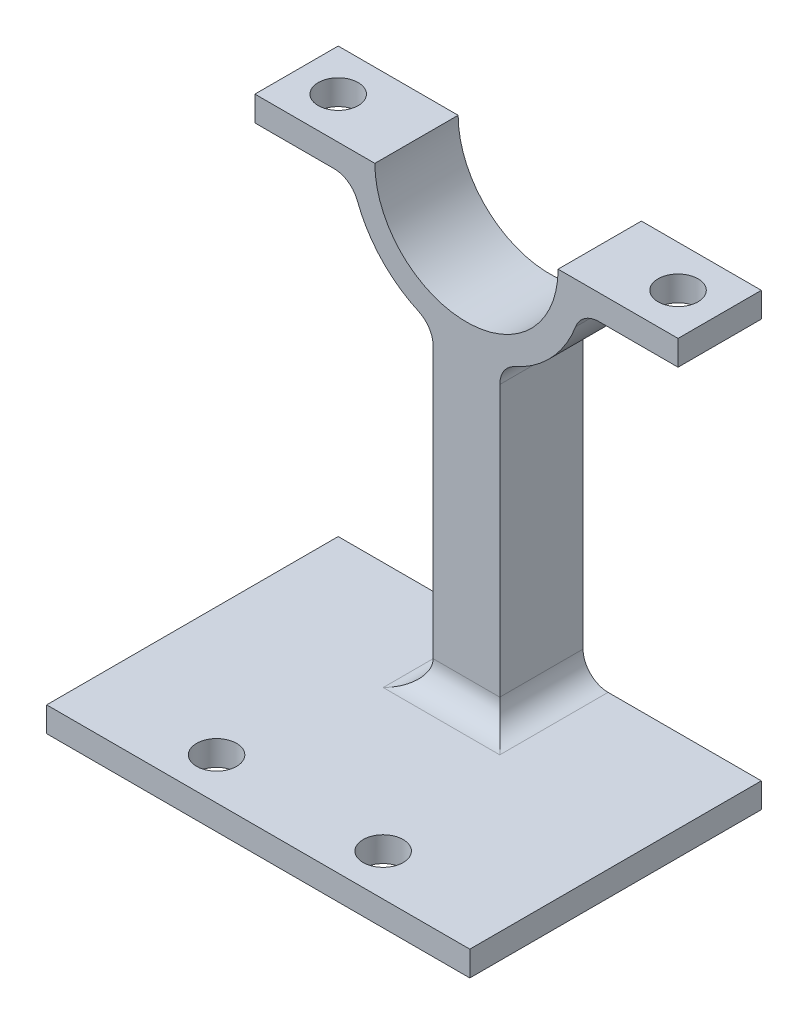
ISO-10303-21;
HEADER;
FILE_DESCRIPTION(('STEP AP214'),'2;1');
FILE_NAME('part.step','',(''),(''),'','','');
FILE_SCHEMA(('AUTOMOTIVE_DESIGN { 1 0 10303 214 1 1 1 1 }'));
ENDSEC;
DATA;
#1=APPLICATION_CONTEXT('core data for automotive mechanical design processes');
#2=APPLICATION_PROTOCOL_DEFINITION('international standard','automotive_design',2000,#1);
#3=PRODUCT_CONTEXT('',#1,'mechanical');
#4=PRODUCT('Part','Part','',(#3));
#5=PRODUCT_RELATED_PRODUCT_CATEGORY('part','',(#4));
#6=PRODUCT_DEFINITION_FORMATION('','',#4);
#7=PRODUCT_DEFINITION_CONTEXT('part definition',#1,'design');
#8=PRODUCT_DEFINITION('design','',#6,#7);
#9=PRODUCT_DEFINITION_SHAPE('','',#8);
#10=(LENGTH_UNIT() NAMED_UNIT(*) SI_UNIT(.MILLI.,.METRE.));
#11=(NAMED_UNIT(*) PLANE_ANGLE_UNIT() SI_UNIT($,.RADIAN.));
#12=(NAMED_UNIT(*) SI_UNIT($,.STERADIAN.) SOLID_ANGLE_UNIT());
#13=UNCERTAINTY_MEASURE_WITH_UNIT(LENGTH_MEASURE(1.E-05),#10,'distance_accuracy_value','');
#14=(GEOMETRIC_REPRESENTATION_CONTEXT(3) GLOBAL_UNCERTAINTY_ASSIGNED_CONTEXT((#13)) GLOBAL_UNIT_ASSIGNED_CONTEXT((#10,
#11,#12)) REPRESENTATION_CONTEXT('',''));
#15=CARTESIAN_POINT('',(0.,0.,0.));
#16=DIRECTION('',(0.,0.,1.));
#17=DIRECTION('',(1.,0.,0.));
#18=AXIS2_PLACEMENT_3D('',#15,#16,#17);
#19=CARTESIAN_POINT('',(0.,0.,2.5));
#20=DIRECTION('',(0.,0.,-1.));
#21=DIRECTION('',(-1.,0.,0.));
#22=AXIS2_PLACEMENT_3D('',#19,#20,#21);
#23=CYLINDRICAL_SURFACE('',#22,7.);
#24=CARTESIAN_POINT('',(0.,0.,2.5));
#25=DIRECTION('',(0.,0.,1.));
#26=DIRECTION('',(1.,0.,0.));
#27=AXIS2_PLACEMENT_3D('',#24,#25,#26);
#28=CIRCLE('',#27,7.);
#29=CARTESIAN_POINT('',(-6.54951859082988,-2.47058823529412,2.5));
#30=VERTEX_POINT('',#29);
#31=CARTESIAN_POINT('',(-2.88235294117647,-6.37903139375339,2.5));
#32=VERTEX_POINT('',#31);
#33=EDGE_CURVE('E248',#30,#32,#28,.T.);
#34=ORIENTED_EDGE('',*,*,#33,.F.);
#35=DIRECTION('',(0.,0.,-1.));
#36=VECTOR('',#35,1.);
#37=CARTESIAN_POINT('',(-6.54951859082988,-2.47058823529412,2.5));
#38=LINE('',#37,#36);
#39=CARTESIAN_POINT('',(-6.54951859082988,-2.47058823529412,-2.5));
#40=VERTEX_POINT('',#39);
#41=EDGE_CURVE('E313',#30,#40,#38,.T.);
#42=ORIENTED_EDGE('',*,*,#41,.T.);
#43=CARTESIAN_POINT('',(0.,0.,-2.5));
#44=DIRECTION('',(0.,0.,1.));
#45=DIRECTION('',(1.,0.,0.));
#46=AXIS2_PLACEMENT_3D('',#43,#44,#45);
#47=CIRCLE('',#46,7.);
#48=CARTESIAN_POINT('',(-2.88235294117647,-6.37903139375339,-2.5));
#49=VERTEX_POINT('',#48);
#50=EDGE_CURVE('E268',#40,#49,#47,.T.);
#51=ORIENTED_EDGE('',*,*,#50,.T.);
#52=DIRECTION('',(0.,0.,-1.));
#53=VECTOR('',#52,1.);
#54=CARTESIAN_POINT('',(-2.88235294117647,-6.37903139375339,2.5));
#55=LINE('',#54,#53);
#56=EDGE_CURVE('E310',#49,#32,#55,.F.);
#57=ORIENTED_EDGE('',*,*,#56,.T.);
#58=EDGE_LOOP('',(#34,#42,#51,#57));
#59=FACE_BOUND('',#58,.T.);
#60=ADVANCED_FACE('F32',(#59),#23,.T.);
#61=CARTESIAN_POINT('',(2.88235294117647,-6.37903139375339,2.5));
#62=VERTEX_POINT('',#61);
#63=CARTESIAN_POINT('',(6.54951859082988,-2.47058823529412,2.5));
#64=VERTEX_POINT('',#63);
#65=EDGE_CURVE('E245',#62,#64,#28,.T.);
#66=ORIENTED_EDGE('',*,*,#65,.F.);
#67=DIRECTION('',(0.,0.,-1.));
#68=VECTOR('',#67,1.);
#69=CARTESIAN_POINT('',(2.88235294117647,-6.37903139375339,2.5));
#70=LINE('',#69,#68);
#71=CARTESIAN_POINT('',(2.88235294117647,-6.37903139375339,-2.5));
#72=VERTEX_POINT('',#71);
#73=EDGE_CURVE('E320',#62,#72,#70,.T.);
#74=ORIENTED_EDGE('',*,*,#73,.T.);
#75=CARTESIAN_POINT('',(6.54951859082988,-2.47058823529412,-2.5));
#76=VERTEX_POINT('',#75);
#77=EDGE_CURVE('E266',#72,#76,#47,.T.);
#78=ORIENTED_EDGE('',*,*,#77,.T.);
#79=DIRECTION('',(0.,0.,-1.));
#80=VECTOR('',#79,1.);
#81=CARTESIAN_POINT('',(6.54951859082989,-2.47058823529412,2.5));
#82=LINE('',#81,#80);
#83=EDGE_CURVE('E318',#76,#64,#82,.F.);
#84=ORIENTED_EDGE('',*,*,#83,.T.);
#85=EDGE_LOOP('',(#66,#74,#78,#84));
#86=FACE_BOUND('',#85,.T.);
#87=ADVANCED_FACE('F402',(#86),#23,.T.);
#88=CARTESIAN_POINT('',(0.,0.,2.5));
#89=DIRECTION('',(0.,0.,-1.));
#90=DIRECTION('',(-1.,0.,0.));
#91=AXIS2_PLACEMENT_3D('',#88,#89,#90);
#92=CYLINDRICAL_SURFACE('',#91,5.5);
#93=CARTESIAN_POINT('',(0.,0.,-2.5));
#94=DIRECTION('',(0.,0.,-1.));
#95=DIRECTION('',(-1.,0.,0.));
#96=AXIS2_PLACEMENT_3D('',#93,#94,#95);
#97=CIRCLE('',#96,5.5);
#98=CARTESIAN_POINT('',(5.5,0.,-2.5));
#99=VERTEX_POINT('',#98);
#100=CARTESIAN_POINT('',(-5.5,0.,-2.5));
#101=VERTEX_POINT('',#100);
#102=EDGE_CURVE('E256',#99,#101,#97,.T.);
#103=ORIENTED_EDGE('',*,*,#102,.T.);
#104=DIRECTION('',(0.,0.,-1.));
#105=VECTOR('',#104,1.);
#106=CARTESIAN_POINT('',(-5.5,0.,2.5));
#107=LINE('',#106,#105);
#108=CARTESIAN_POINT('',(-5.5,0.,2.5));
#109=VERTEX_POINT('',#108);
#110=EDGE_CURVE('E288',#109,#101,#107,.T.);
#111=ORIENTED_EDGE('',*,*,#110,.F.);
#112=CARTESIAN_POINT('',(0.,0.,2.5));
#113=DIRECTION('',(0.,0.,-1.));
#114=DIRECTION('',(-1.,0.,0.));
#115=AXIS2_PLACEMENT_3D('',#112,#113,#114);
#116=CIRCLE('',#115,5.5);
#117=CARTESIAN_POINT('',(5.5,0.,2.5));
#118=VERTEX_POINT('',#117);
#119=EDGE_CURVE('E234',#118,#109,#116,.T.);
#120=ORIENTED_EDGE('',*,*,#119,.F.);
#121=DIRECTION('',(0.,0.,-1.));
#122=VECTOR('',#121,1.);
#123=CARTESIAN_POINT('',(5.5,0.,2.5));
#124=LINE('',#123,#122);
#125=EDGE_CURVE('E255',#118,#99,#124,.T.);
#126=ORIENTED_EDGE('',*,*,#125,.T.);
#127=EDGE_LOOP('',(#103,#111,#120,#126));
#128=FACE_BOUND('',#127,.T.);
#129=ADVANCED_FACE('F420',(#128),#92,.F.);
#130=CARTESIAN_POINT('',(-5.5,0.,2.5));
#131=DIRECTION('',(0.,-1.,0.));
#132=DIRECTION('',(1.,0.,0.));
#133=AXIS2_PLACEMENT_3D('',#130,#131,#132);
#134=PLANE('',#133);
#135=CARTESIAN_POINT('',(-10.2,0.,0.));
#136=DIRECTION('',(0.,1.,0.));
#137=DIRECTION('',(0.,0.,1.));
#138=AXIS2_PLACEMENT_3D('',#135,#136,#137);
#139=CIRCLE('',#138,1.2);
#140=CARTESIAN_POINT('',(-10.2,0.,1.2));
#141=VERTEX_POINT('',#140);
#142=EDGE_CURVE('E225',#141,#141,#139,.T.);
#143=ORIENTED_EDGE('',*,*,#142,.F.);
#144=EDGE_LOOP('',(#143));
#145=FACE_BOUND('',#144,.T.);
#146=DIRECTION('',(-1.,0.,0.));
#147=VECTOR('',#146,1.);
#148=CARTESIAN_POINT('',(-5.5,0.,-2.5));
#149=LINE('',#148,#147);
#150=CARTESIAN_POINT('',(-12.7,0.,-2.5));
#151=VERTEX_POINT('',#150);
#152=EDGE_CURVE('E259',#101,#151,#149,.T.);
#153=ORIENTED_EDGE('',*,*,#152,.T.);
#154=DIRECTION('',(0.,0.,-1.));
#155=VECTOR('',#154,1.);
#156=CARTESIAN_POINT('',(-12.7,0.,2.5));
#157=LINE('',#156,#155);
#158=CARTESIAN_POINT('',(-12.7,0.,2.5));
#159=VERTEX_POINT('',#158);
#160=EDGE_CURVE('E285',#159,#151,#157,.T.);
#161=ORIENTED_EDGE('',*,*,#160,.F.);
#162=DIRECTION('',(-1.,0.,0.));
#163=VECTOR('',#162,1.);
#164=CARTESIAN_POINT('',(-5.5,0.,2.5));
#165=LINE('',#164,#163);
#166=EDGE_CURVE('E237',#109,#159,#165,.T.);
#167=ORIENTED_EDGE('',*,*,#166,.F.);
#168=ORIENTED_EDGE('',*,*,#110,.T.);
#169=EDGE_LOOP('',(#153,#161,#167,#168));
#170=FACE_BOUND('',#169,.T.);
#171=ADVANCED_FACE('F422',(#145,#170),#134,.F.);
#172=CARTESIAN_POINT('',(-12.7,0.,2.5));
#173=DIRECTION('',(1.,0.,0.));
#174=DIRECTION('',(0.,0.,-1.));
#175=AXIS2_PLACEMENT_3D('',#172,#173,#174);
#176=PLANE('',#175);
#177=DIRECTION('',(0.,-1.,0.));
#178=VECTOR('',#177,1.);
#179=CARTESIAN_POINT('',(-12.7,0.,-2.5));
#180=LINE('',#179,#178);
#181=CARTESIAN_POINT('',(-12.7,-1.5,-2.5));
#182=VERTEX_POINT('',#181);
#183=EDGE_CURVE('E261',#151,#182,#180,.T.);
#184=ORIENTED_EDGE('',*,*,#183,.T.);
#185=DIRECTION('',(0.,0.,-1.));
#186=VECTOR('',#185,1.);
#187=CARTESIAN_POINT('',(-12.7,-1.5,2.5));
#188=LINE('',#187,#186);
#189=CARTESIAN_POINT('',(-12.7,-1.5,2.5));
#190=VERTEX_POINT('',#189);
#191=EDGE_CURVE('E282',#190,#182,#188,.T.);
#192=ORIENTED_EDGE('',*,*,#191,.F.);
#193=DIRECTION('',(0.,-1.,0.));
#194=VECTOR('',#193,1.);
#195=CARTESIAN_POINT('',(-12.7,0.,2.5));
#196=LINE('',#195,#194);
#197=EDGE_CURVE('E240',#159,#190,#196,.T.);
#198=ORIENTED_EDGE('',*,*,#197,.F.);
#199=ORIENTED_EDGE('',*,*,#160,.T.);
#200=EDGE_LOOP('',(#184,#192,#198,#199));
#201=FACE_BOUND('',#200,.T.);
#202=ADVANCED_FACE('F429',(#201),#176,.F.);
#203=CARTESIAN_POINT('',(-12.7,-1.5,2.5));
#204=DIRECTION('',(0.,1.,0.));
#205=DIRECTION('',(-1.,0.,0.));
#206=AXIS2_PLACEMENT_3D('',#203,#204,#205);
#207=PLANE('',#206);
#208=CARTESIAN_POINT('',(-10.2,-1.5,0.));
#209=DIRECTION('',(0.,1.,0.));
#210=DIRECTION('',(-1.,0.,0.));
#211=AXIS2_PLACEMENT_3D('',#208,#209,#210);
#212=CIRCLE('',#211,1.2);
#213=CARTESIAN_POINT('',(-11.4,-1.5,0.));
#214=VERTEX_POINT('',#213);
#215=EDGE_CURVE('E233',#214,#214,#212,.T.);
#216=ORIENTED_EDGE('',*,*,#215,.T.);
#217=EDGE_LOOP('',(#216));
#218=FACE_BOUND('',#217,.T.);
#219=DIRECTION('',(1.,0.,0.));
#220=VECTOR('',#219,1.);
#221=CARTESIAN_POINT('',(-12.7,-1.5,-2.5));
#222=LINE('',#221,#220);
#223=CARTESIAN_POINT('',(-7.95298686029343,-1.5,-2.5));
#224=VERTEX_POINT('',#223);
#225=EDGE_CURVE('E263',#182,#224,#222,.T.);
#226=ORIENTED_EDGE('',*,*,#225,.T.);
#227=DIRECTION('',(0.,0.,1.));
#228=VECTOR('',#227,1.);
#229=CARTESIAN_POINT('',(-7.95298686029343,-1.5,2.5));
#230=LINE('',#229,#228);
#231=CARTESIAN_POINT('',(-7.95298686029343,-1.5,2.5));
#232=VERTEX_POINT('',#231);
#233=EDGE_CURVE('E316',#224,#232,#230,.T.);
#234=ORIENTED_EDGE('',*,*,#233,.T.);
#235=DIRECTION('',(1.,0.,0.));
#236=VECTOR('',#235,1.);
#237=CARTESIAN_POINT('',(-12.7,-1.5,2.5));
#238=LINE('',#237,#236);
#239=EDGE_CURVE('E242',#190,#232,#238,.T.);
#240=ORIENTED_EDGE('',*,*,#239,.F.);
#241=ORIENTED_EDGE('',*,*,#191,.T.);
#242=EDGE_LOOP('',(#226,#234,#240,#241));
#243=FACE_BOUND('',#242,.T.);
#244=ADVANCED_FACE('F433',(#218,#243),#207,.F.);
#245=CARTESIAN_POINT('',(12.7,-1.5,2.5));
#246=DIRECTION('',(0.,1.,0.));
#247=DIRECTION('',(-1.,0.,0.));
#248=AXIS2_PLACEMENT_3D('',#245,#246,#247);
#249=PLANE('',#248);
#250=CARTESIAN_POINT('',(10.2,-1.5,0.));
#251=DIRECTION('',(0.,1.,0.));
#252=DIRECTION('',(-1.,0.,0.));
#253=AXIS2_PLACEMENT_3D('',#250,#251,#252);
#254=CIRCLE('',#253,1.2);
#255=CARTESIAN_POINT('',(9.,-1.5,0.));
#256=VERTEX_POINT('',#255);
#257=EDGE_CURVE('E228',#256,#256,#254,.T.);
#258=ORIENTED_EDGE('',*,*,#257,.T.);
#259=EDGE_LOOP('',(#258));
#260=FACE_BOUND('',#259,.T.);
#261=DIRECTION('',(1.,0.,0.));
#262=VECTOR('',#261,1.);
#263=CARTESIAN_POINT('',(12.7,-1.5,2.5));
#264=LINE('',#263,#262);
#265=CARTESIAN_POINT('',(7.95298686029343,-1.5,2.5));
#266=VERTEX_POINT('',#265);
#267=CARTESIAN_POINT('',(12.7,-1.5,2.5));
#268=VERTEX_POINT('',#267);
#269=EDGE_CURVE('E249',#266,#268,#264,.T.);
#270=ORIENTED_EDGE('',*,*,#269,.F.);
#271=DIRECTION('',(0.,0.,1.));
#272=VECTOR('',#271,1.);
#273=CARTESIAN_POINT('',(7.95298686029343,-1.5,-2.5));
#274=LINE('',#273,#272);
#275=CARTESIAN_POINT('',(7.95298686029343,-1.5,-2.5));
#276=VERTEX_POINT('',#275);
#277=EDGE_CURVE('E323',#266,#276,#274,.F.);
#278=ORIENTED_EDGE('',*,*,#277,.T.);
#279=DIRECTION('',(1.,0.,0.));
#280=VECTOR('',#279,1.);
#281=CARTESIAN_POINT('',(12.7,-1.5,-2.5));
#282=LINE('',#281,#280);
#283=CARTESIAN_POINT('',(12.7,-1.5,-2.5));
#284=VERTEX_POINT('',#283);
#285=EDGE_CURVE('E269',#276,#284,#282,.T.);
#286=ORIENTED_EDGE('',*,*,#285,.T.);
#287=DIRECTION('',(0.,0.,-1.));
#288=VECTOR('',#287,1.);
#289=CARTESIAN_POINT('',(12.7,-1.5,2.5));
#290=LINE('',#289,#288);
#291=EDGE_CURVE('E279',#268,#284,#290,.T.);
#292=ORIENTED_EDGE('',*,*,#291,.F.);
#293=EDGE_LOOP('',(#270,#278,#286,#292));
#294=FACE_BOUND('',#293,.T.);
#295=ADVANCED_FACE('F406',(#260,#294),#249,.F.);
#296=CARTESIAN_POINT('',(12.7,0.,2.5));
#297=DIRECTION('',(-1.,0.,0.));
#298=DIRECTION('',(0.,0.,1.));
#299=AXIS2_PLACEMENT_3D('',#296,#297,#298);
#300=PLANE('',#299);
#301=DIRECTION('',(0.,1.,0.));
#302=VECTOR('',#301,1.);
#303=CARTESIAN_POINT('',(12.7,0.,-2.5));
#304=LINE('',#303,#302);
#305=CARTESIAN_POINT('',(12.7,0.,-2.5));
#306=VERTEX_POINT('',#305);
#307=EDGE_CURVE('E271',#284,#306,#304,.T.);
#308=ORIENTED_EDGE('',*,*,#307,.T.);
#309=DIRECTION('',(0.,0.,-1.));
#310=VECTOR('',#309,1.);
#311=CARTESIAN_POINT('',(12.7,0.,2.5));
#312=LINE('',#311,#310);
#313=CARTESIAN_POINT('',(12.7,0.,2.5));
#314=VERTEX_POINT('',#313);
#315=EDGE_CURVE('E276',#314,#306,#312,.T.);
#316=ORIENTED_EDGE('',*,*,#315,.F.);
#317=DIRECTION('',(0.,1.,0.));
#318=VECTOR('',#317,1.);
#319=CARTESIAN_POINT('',(12.7,0.,2.5));
#320=LINE('',#319,#318);
#321=EDGE_CURVE('E251',#268,#314,#320,.T.);
#322=ORIENTED_EDGE('',*,*,#321,.F.);
#323=ORIENTED_EDGE('',*,*,#291,.T.);
#324=EDGE_LOOP('',(#308,#316,#322,#323));
#325=FACE_BOUND('',#324,.T.);
#326=ADVANCED_FACE('F411',(#325),#300,.F.);
#327=CARTESIAN_POINT('',(5.5,0.,2.5));
#328=DIRECTION('',(0.,-1.,0.));
#329=DIRECTION('',(1.,0.,0.));
#330=AXIS2_PLACEMENT_3D('',#327,#328,#329);
#331=PLANE('',#330);
#332=CARTESIAN_POINT('',(10.2,0.,0.));
#333=DIRECTION('',(0.,1.,0.));
#334=DIRECTION('',(0.,0.,-1.));
#335=AXIS2_PLACEMENT_3D('',#332,#333,#334);
#336=CIRCLE('',#335,1.2);
#337=CARTESIAN_POINT('',(10.2,0.,-1.2));
#338=VERTEX_POINT('',#337);
#339=EDGE_CURVE('E223',#338,#338,#336,.T.);
#340=ORIENTED_EDGE('',*,*,#339,.F.);
#341=EDGE_LOOP('',(#340));
#342=FACE_BOUND('',#341,.T.);
#343=DIRECTION('',(-1.,0.,0.));
#344=VECTOR('',#343,1.);
#345=CARTESIAN_POINT('',(5.5,0.,-2.5));
#346=LINE('',#345,#344);
#347=EDGE_CURVE('E238',#306,#99,#346,.T.);
#348=ORIENTED_EDGE('',*,*,#347,.T.);
#349=ORIENTED_EDGE('',*,*,#125,.F.);
#350=DIRECTION('',(-1.,0.,0.));
#351=VECTOR('',#350,1.);
#352=CARTESIAN_POINT('',(5.5,0.,2.5));
#353=LINE('',#352,#351);
#354=EDGE_CURVE('E253',#314,#118,#353,.T.);
#355=ORIENTED_EDGE('',*,*,#354,.F.);
#356=ORIENTED_EDGE('',*,*,#315,.T.);
#357=EDGE_LOOP('',(#348,#349,#355,#356));
#358=FACE_BOUND('',#357,.T.);
#359=ADVANCED_FACE('F417',(#342,#358),#331,.F.);
#360=CARTESIAN_POINT('',(0.,0.,2.5));
#361=DIRECTION('',(0.,0.,-1.));
#362=DIRECTION('',(-1.,0.,0.));
#363=AXIS2_PLACEMENT_3D('',#360,#361,#362);
#364=PLANE('',#363);
#365=DIRECTION('',(0.,-1.,0.));
#366=VECTOR('',#365,1.);
#367=CARTESIAN_POINT('',(-2.,0.001000000000001,2.5));
#368=LINE('',#367,#366);
#369=CARTESIAN_POINT('',(-2.,-7.74596669241483,2.5));
#370=VERTEX_POINT('',#369);
#371=CARTESIAN_POINT('',(-2.,-24.,2.5));
#372=VERTEX_POINT('',#371);
#373=EDGE_CURVE('E210',#370,#372,#368,.T.);
#374=ORIENTED_EDGE('',*,*,#373,.T.);
#375=DIRECTION('',(1.,0.,0.));
#376=VECTOR('',#375,1.);
#377=CARTESIAN_POINT('',(0.,-24.,2.5));
#378=LINE('',#377,#376);
#379=CARTESIAN_POINT('',(2.,-24.,2.5));
#380=VERTEX_POINT('',#379);
#381=EDGE_CURVE('E291',#372,#380,#378,.T.);
#382=ORIENTED_EDGE('',*,*,#381,.T.);
#383=DIRECTION('',(0.,-1.,0.));
#384=VECTOR('',#383,1.);
#385=CARTESIAN_POINT('',(2.,0.001000000000001,2.5));
#386=LINE('',#385,#384);
#387=CARTESIAN_POINT('',(2.,-7.74596669241483,2.5));
#388=VERTEX_POINT('',#387);
#389=EDGE_CURVE('E218',#388,#380,#386,.T.);
#390=ORIENTED_EDGE('',*,*,#389,.F.);
#391=CARTESIAN_POINT('',(3.5,-7.74596669241483,2.5));
#392=DIRECTION('',(0.,0.,-1.));
#393=DIRECTION('',(-1.,0.,0.));
#394=AXIS2_PLACEMENT_3D('',#391,#392,#393);
#395=CIRCLE('',#394,1.5);
#396=EDGE_CURVE('E339',#388,#62,#395,.T.);
#397=ORIENTED_EDGE('',*,*,#396,.T.);
#398=ORIENTED_EDGE('',*,*,#65,.T.);
#399=CARTESIAN_POINT('',(7.95298686029343,-3.,2.5));
#400=DIRECTION('',(0.,0.,-1.));
#401=DIRECTION('',(-1.,0.,0.));
#402=AXIS2_PLACEMENT_3D('',#399,#400,#401);
#403=CIRCLE('',#402,1.5);
#404=EDGE_CURVE('E11',#64,#266,#403,.T.);
#405=ORIENTED_EDGE('',*,*,#404,.T.);
#406=ORIENTED_EDGE('',*,*,#269,.T.);
#407=ORIENTED_EDGE('',*,*,#321,.T.);
#408=ORIENTED_EDGE('',*,*,#354,.T.);
#409=ORIENTED_EDGE('',*,*,#119,.T.);
#410=ORIENTED_EDGE('',*,*,#166,.T.);
#411=ORIENTED_EDGE('',*,*,#197,.T.);
#412=ORIENTED_EDGE('',*,*,#239,.T.);
#413=CARTESIAN_POINT('',(-7.95298686029343,-3.,2.5));
#414=DIRECTION('',(0.,0.,-1.));
#415=DIRECTION('',(-1.,0.,0.));
#416=AXIS2_PLACEMENT_3D('',#413,#414,#415);
#417=CIRCLE('',#416,1.5);
#418=EDGE_CURVE('E331',#232,#30,#417,.T.);
#419=ORIENTED_EDGE('',*,*,#418,.T.);
#420=ORIENTED_EDGE('',*,*,#33,.T.);
#421=CARTESIAN_POINT('',(-3.5,-7.74596669241483,2.5));
#422=DIRECTION('',(0.,0.,-1.));
#423=DIRECTION('',(-1.,0.,0.));
#424=AXIS2_PLACEMENT_3D('',#421,#422,#423);
#425=CIRCLE('',#424,1.5);
#426=EDGE_CURVE('E333',#32,#370,#425,.T.);
#427=ORIENTED_EDGE('',*,*,#426,.T.);
#428=EDGE_LOOP('',(#374,#382,#390,#397,#398,#405,#406,#407,#408,#409,#410,#411,#412,#419,#420,#427));
#429=FACE_BOUND('',#428,.T.);
#430=ADVANCED_FACE('F389',(#429),#364,.F.);
#431=CARTESIAN_POINT('',(0.,0.,-2.5));
#432=DIRECTION('',(0.,0.,-1.));
#433=DIRECTION('',(-1.,0.,0.));
#434=AXIS2_PLACEMENT_3D('',#431,#432,#433);
#435=PLANE('',#434);
#436=ORIENTED_EDGE('',*,*,#102,.F.);
#437=ORIENTED_EDGE('',*,*,#347,.F.);
#438=ORIENTED_EDGE('',*,*,#307,.F.);
#439=ORIENTED_EDGE('',*,*,#285,.F.);
#440=CARTESIAN_POINT('',(7.95298686029343,-3.,-2.5));
#441=DIRECTION('',(0.,0.,-1.));
#442=DIRECTION('',(-1.,0.,0.));
#443=AXIS2_PLACEMENT_3D('',#440,#441,#442);
#444=CIRCLE('',#443,1.5);
#445=EDGE_CURVE('E41',#276,#76,#444,.F.);
#446=ORIENTED_EDGE('',*,*,#445,.T.);
#447=ORIENTED_EDGE('',*,*,#77,.F.);
#448=CARTESIAN_POINT('',(3.5,-7.74596669241483,-2.5));
#449=DIRECTION('',(0.,0.,-1.));
#450=DIRECTION('',(-1.,0.,0.));
#451=AXIS2_PLACEMENT_3D('',#448,#449,#450);
#452=CIRCLE('',#451,1.5);
#453=CARTESIAN_POINT('',(2.,-7.74596669241483,-2.5));
#454=VERTEX_POINT('',#453);
#455=EDGE_CURVE('E337',#72,#454,#452,.F.);
#456=ORIENTED_EDGE('',*,*,#455,.T.);
#457=DIRECTION('',(0.,-1.,0.));
#458=VECTOR('',#457,1.);
#459=CARTESIAN_POINT('',(2.,0.001000000000001,-2.5));
#460=LINE('',#459,#458);
#461=CARTESIAN_POINT('',(2.,-24.,-2.5));
#462=VERTEX_POINT('',#461);
#463=EDGE_CURVE('E221',#454,#462,#460,.T.);
#464=ORIENTED_EDGE('',*,*,#463,.T.);
#465=CARTESIAN_POINT('',(3.5,-24.,-2.5));
#466=DIRECTION('',(0.,0.,-1.));
#467=DIRECTION('',(-1.,0.,0.));
#468=AXIS2_PLACEMENT_3D('',#465,#466,#467);
#469=CIRCLE('',#468,1.5);
#470=CARTESIAN_POINT('',(3.5,-25.5,-2.5));
#471=VERTEX_POINT('',#470);
#472=EDGE_CURVE('E325',#462,#471,#469,.F.);
#473=ORIENTED_EDGE('',*,*,#472,.T.);
#474=DIRECTION('',(1.,0.,0.));
#475=VECTOR('',#474,1.);
#476=CARTESIAN_POINT('',(12.7,-25.5,-2.5));
#477=LINE('',#476,#475);
#478=CARTESIAN_POINT('',(12.7,-25.5,-2.5));
#479=VERTEX_POINT('',#478);
#480=EDGE_CURVE('E367',#471,#479,#477,.T.);
#481=ORIENTED_EDGE('',*,*,#480,.T.);
#482=DIRECTION('',(0.,1.,0.));
#483=VECTOR('',#482,1.);
#484=CARTESIAN_POINT('',(12.7,-27.,-2.5));
#485=LINE('',#484,#483);
#486=CARTESIAN_POINT('',(12.7,-27.,-2.5));
#487=VERTEX_POINT('',#486);
#488=EDGE_CURVE('E361',#487,#479,#485,.T.);
#489=ORIENTED_EDGE('',*,*,#488,.F.);
#490=DIRECTION('',(1.,0.,0.));
#491=VECTOR('',#490,1.);
#492=CARTESIAN_POINT('',(12.7,-27.,-2.5));
#493=LINE('',#492,#491);
#494=CARTESIAN_POINT('',(-12.7,-27.,-2.5));
#495=VERTEX_POINT('',#494);
#496=EDGE_CURVE('E198',#495,#487,#493,.T.);
#497=ORIENTED_EDGE('',*,*,#496,.F.);
#498=DIRECTION('',(0.,1.,0.));
#499=VECTOR('',#498,1.);
#500=CARTESIAN_POINT('',(-12.7,-27.,-2.5));
#501=LINE('',#500,#499);
#502=CARTESIAN_POINT('',(-12.7,-25.5,-2.5));
#503=VERTEX_POINT('',#502);
#504=EDGE_CURVE('E212',#495,#503,#501,.T.);
#505=ORIENTED_EDGE('',*,*,#504,.T.);
#506=CARTESIAN_POINT('',(-3.5,-25.5,-2.5));
#507=VERTEX_POINT('',#506);
#508=EDGE_CURVE('E202',#503,#507,#477,.T.);
#509=ORIENTED_EDGE('',*,*,#508,.T.);
#510=CARTESIAN_POINT('',(-3.5,-24.,-2.5));
#511=DIRECTION('',(0.,0.,-1.));
#512=DIRECTION('',(-1.,0.,0.));
#513=AXIS2_PLACEMENT_3D('',#510,#511,#512);
#514=CIRCLE('',#513,1.5);
#515=CARTESIAN_POINT('',(-2.,-24.,-2.5));
#516=VERTEX_POINT('',#515);
#517=EDGE_CURVE('E327',#507,#516,#514,.F.);
#518=ORIENTED_EDGE('',*,*,#517,.T.);
#519=DIRECTION('',(0.,-1.,0.));
#520=VECTOR('',#519,1.);
#521=CARTESIAN_POINT('',(-2.,0.001000000000001,-2.5));
#522=LINE('',#521,#520);
#523=CARTESIAN_POINT('',(-2.,-7.74596669241483,-2.5));
#524=VERTEX_POINT('',#523);
#525=EDGE_CURVE('E207',#524,#516,#522,.T.);
#526=ORIENTED_EDGE('',*,*,#525,.F.);
#527=CARTESIAN_POINT('',(-3.5,-7.74596669241483,-2.5));
#528=DIRECTION('',(0.,0.,-1.));
#529=DIRECTION('',(-1.,0.,0.));
#530=AXIS2_PLACEMENT_3D('',#527,#528,#529);
#531=CIRCLE('',#530,1.5);
#532=EDGE_CURVE('E335',#524,#49,#531,.F.);
#533=ORIENTED_EDGE('',*,*,#532,.T.);
#534=ORIENTED_EDGE('',*,*,#50,.F.);
#535=CARTESIAN_POINT('',(-7.95298686029343,-3.,-2.5));
#536=DIRECTION('',(0.,0.,-1.));
#537=DIRECTION('',(-1.,0.,0.));
#538=AXIS2_PLACEMENT_3D('',#535,#536,#537);
#539=CIRCLE('',#538,1.5);
#540=EDGE_CURVE('E329',#40,#224,#539,.F.);
#541=ORIENTED_EDGE('',*,*,#540,.T.);
#542=ORIENTED_EDGE('',*,*,#225,.F.);
#543=ORIENTED_EDGE('',*,*,#183,.F.);
#544=ORIENTED_EDGE('',*,*,#152,.F.);
#545=EDGE_LOOP('',(#436,#437,#438,#439,#446,#447,#456,#464,#473,#481,#489,#497,#505,#509,#518,
#526,#533,#534,#541,#542,#543,#544));
#546=FACE_BOUND('',#545,.T.);
#547=ADVANCED_FACE('F374',(#546),#435,.T.);
#548=CARTESIAN_POINT('',(10.2,-7.,0.));
#549=DIRECTION('',(0.,1.,0.));
#550=DIRECTION('',(0.,0.,1.));
#551=AXIS2_PLACEMENT_3D('',#548,#549,#550);
#552=CYLINDRICAL_SURFACE('',#551,1.2);
#553=ORIENTED_EDGE('',*,*,#339,.T.);
#554=EDGE_LOOP('',(#553));
#555=FACE_BOUND('',#554,.T.);
#556=ORIENTED_EDGE('',*,*,#257,.F.);
#557=EDGE_LOOP('',(#556));
#558=FACE_BOUND('',#557,.T.);
#559=ADVANCED_FACE('F459',(#555,#558),#552,.F.);
#560=CARTESIAN_POINT('',(-10.2,-7.,0.));
#561=DIRECTION('',(0.,1.,0.));
#562=DIRECTION('',(0.,0.,1.));
#563=AXIS2_PLACEMENT_3D('',#560,#561,#562);
#564=CYLINDRICAL_SURFACE('',#563,1.2);
#565=ORIENTED_EDGE('',*,*,#142,.T.);
#566=EDGE_LOOP('',(#565));
#567=FACE_BOUND('',#566,.T.);
#568=ORIENTED_EDGE('',*,*,#215,.F.);
#569=EDGE_LOOP('',(#568));
#570=FACE_BOUND('',#569,.T.);
#571=ADVANCED_FACE('F452',(#567,#570),#564,.F.);
#572=CARTESIAN_POINT('',(-2.,0.001000000000001,-2.5));
#573=DIRECTION('',(1.,0.,0.));
#574=DIRECTION('',(0.,0.,-1.));
#575=AXIS2_PLACEMENT_3D('',#572,#573,#574);
#576=PLANE('',#575);
#577=ORIENTED_EDGE('',*,*,#525,.T.);
#578=DIRECTION('',(0.,0.,1.));
#579=VECTOR('',#578,1.);
#580=CARTESIAN_POINT('',(-2.,-24.,-2.5));
#581=LINE('',#580,#579);
#582=EDGE_CURVE('E308',#516,#372,#581,.T.);
#583=ORIENTED_EDGE('',*,*,#582,.T.);
#584=ORIENTED_EDGE('',*,*,#373,.F.);
#585=DIRECTION('',(0.,0.,1.));
#586=VECTOR('',#585,1.);
#587=CARTESIAN_POINT('',(-2.,-7.74596669241483,-2.5));
#588=LINE('',#587,#586);
#589=EDGE_CURVE('E306',#370,#524,#588,.F.);
#590=ORIENTED_EDGE('',*,*,#589,.T.);
#591=EDGE_LOOP('',(#577,#583,#584,#590));
#592=FACE_BOUND('',#591,.T.);
#593=ADVANCED_FACE('F449',(#592),#576,.F.);
#594=CARTESIAN_POINT('',(2.,0.001000000000001,-2.5));
#595=DIRECTION('',(-1.,0.,0.));
#596=DIRECTION('',(0.,0.,1.));
#597=AXIS2_PLACEMENT_3D('',#594,#595,#596);
#598=PLANE('',#597);
#599=ORIENTED_EDGE('',*,*,#389,.T.);
#600=DIRECTION('',(0.,0.,-1.));
#601=VECTOR('',#600,1.);
#602=CARTESIAN_POINT('',(2.,-24.,-2.5));
#603=LINE('',#602,#601);
#604=EDGE_CURVE('E304',#380,#462,#603,.T.);
#605=ORIENTED_EDGE('',*,*,#604,.T.);
#606=ORIENTED_EDGE('',*,*,#463,.F.);
#607=DIRECTION('',(0.,0.,1.));
#608=VECTOR('',#607,1.);
#609=CARTESIAN_POINT('',(2.,-7.74596669241483,2.5));
#610=LINE('',#609,#608);
#611=EDGE_CURVE('E302',#454,#388,#610,.T.);
#612=ORIENTED_EDGE('',*,*,#611,.T.);
#613=EDGE_LOOP('',(#599,#605,#606,#612));
#614=FACE_BOUND('',#613,.T.);
#615=ADVANCED_FACE('F393',(#614),#598,.F.);
#616=CARTESIAN_POINT('',(0.,-25.5,0.));
#617=DIRECTION('',(0.,1.,0.));
#618=DIRECTION('',(0.,0.,1.));
#619=AXIS2_PLACEMENT_3D('',#616,#617,#618);
#620=PLANE('',#619);
#621=CARTESIAN_POINT('',(-5.,-25.5,12.5));
#622=DIRECTION('',(0.,1.,0.));
#623=DIRECTION('',(0.,0.,1.));
#624=AXIS2_PLACEMENT_3D('',#621,#622,#623);
#625=CIRCLE('',#624,1.2);
#626=CARTESIAN_POINT('',(-5.,-25.5,13.7));
#627=VERTEX_POINT('',#626);
#628=EDGE_CURVE('E342',#627,#627,#625,.T.);
#629=ORIENTED_EDGE('',*,*,#628,.F.);
#630=EDGE_LOOP('',(#629));
#631=FACE_BOUND('',#630,.T.);
#632=CARTESIAN_POINT('',(5.,-25.5,12.5));
#633=DIRECTION('',(0.,1.,0.));
#634=DIRECTION('',(0.,0.,1.));
#635=AXIS2_PLACEMENT_3D('',#632,#633,#634);
#636=CIRCLE('',#635,1.2);
#637=CARTESIAN_POINT('',(5.,-25.5,13.7));
#638=VERTEX_POINT('',#637);
#639=EDGE_CURVE('E350',#638,#638,#636,.T.);
#640=ORIENTED_EDGE('',*,*,#639,.F.);
#641=EDGE_LOOP('',(#640));
#642=FACE_BOUND('',#641,.T.);
#643=ORIENTED_EDGE('',*,*,#480,.F.);
#644=DIRECTION('',(0.,0.,-1.));
#645=VECTOR('',#644,1.);
#646=CARTESIAN_POINT('',(3.5,-25.5,0.));
#647=LINE('',#646,#645);
#648=CARTESIAN_POINT('',(3.5,-25.5,4.));
#649=VERTEX_POINT('',#648);
#650=EDGE_CURVE('E300',#471,#649,#647,.F.);
#651=ORIENTED_EDGE('',*,*,#650,.T.);
#652=DIRECTION('',(1.,0.,0.));
#653=VECTOR('',#652,1.);
#654=CARTESIAN_POINT('',(0.,-25.5,4.));
#655=LINE('',#654,#653);
#656=CARTESIAN_POINT('',(-3.5,-25.5,4.));
#657=VERTEX_POINT('',#656);
#658=EDGE_CURVE('E298',#649,#657,#655,.F.);
#659=ORIENTED_EDGE('',*,*,#658,.T.);
#660=DIRECTION('',(0.,0.,1.));
#661=VECTOR('',#660,1.);
#662=CARTESIAN_POINT('',(-3.5,-25.5,0.));
#663=LINE('',#662,#661);
#664=EDGE_CURVE('E296',#657,#507,#663,.F.);
#665=ORIENTED_EDGE('',*,*,#664,.T.);
#666=ORIENTED_EDGE('',*,*,#508,.F.);
#667=DIRECTION('',(0.,0.,-1.));
#668=VECTOR('',#667,1.);
#669=CARTESIAN_POINT('',(-12.7,-25.5,-2.5));
#670=LINE('',#669,#668);
#671=CARTESIAN_POINT('',(-12.7,-25.5,15.));
#672=VERTEX_POINT('',#671);
#673=EDGE_CURVE('E365',#672,#503,#670,.T.);
#674=ORIENTED_EDGE('',*,*,#673,.F.);
#675=DIRECTION('',(-1.,0.,0.));
#676=VECTOR('',#675,1.);
#677=CARTESIAN_POINT('',(-12.7,-25.5,15.));
#678=LINE('',#677,#676);
#679=CARTESIAN_POINT('',(12.7,-25.5,15.));
#680=VERTEX_POINT('',#679);
#681=EDGE_CURVE('E363',#680,#672,#678,.T.);
#682=ORIENTED_EDGE('',*,*,#681,.F.);
#683=DIRECTION('',(0.,0.,1.));
#684=VECTOR('',#683,1.);
#685=CARTESIAN_POINT('',(12.7,-25.5,-2.5));
#686=LINE('',#685,#684);
#687=EDGE_CURVE('E206',#479,#680,#686,.T.);
#688=ORIENTED_EDGE('',*,*,#687,.F.);
#689=EDGE_LOOP('',(#643,#651,#659,#665,#666,#674,#682,#688));
#690=FACE_BOUND('',#689,.T.);
#691=ADVANCED_FACE('F380',(#631,#642,#690),#620,.T.);
#692=CARTESIAN_POINT('',(12.7,-27.,-2.5));
#693=DIRECTION('',(-1.,0.,0.));
#694=DIRECTION('',(0.,0.,1.));
#695=AXIS2_PLACEMENT_3D('',#692,#693,#694);
#696=PLANE('',#695);
#697=ORIENTED_EDGE('',*,*,#687,.T.);
#698=DIRECTION('',(0.,1.,0.));
#699=VECTOR('',#698,1.);
#700=CARTESIAN_POINT('',(12.7,-27.,15.));
#701=LINE('',#700,#699);
#702=CARTESIAN_POINT('',(12.7,-27.,15.));
#703=VERTEX_POINT('',#702);
#704=EDGE_CURVE('E186',#703,#680,#701,.T.);
#705=ORIENTED_EDGE('',*,*,#704,.F.);
#706=DIRECTION('',(0.,0.,1.));
#707=VECTOR('',#706,1.);
#708=CARTESIAN_POINT('',(12.7,-27.,-2.5));
#709=LINE('',#708,#707);
#710=EDGE_CURVE('E193',#487,#703,#709,.T.);
#711=ORIENTED_EDGE('',*,*,#710,.F.);
#712=ORIENTED_EDGE('',*,*,#488,.T.);
#713=EDGE_LOOP('',(#697,#705,#711,#712));
#714=FACE_BOUND('',#713,.T.);
#715=ADVANCED_FACE('F204',(#714),#696,.F.);
#716=CARTESIAN_POINT('',(-12.7,-27.,15.));
#717=DIRECTION('',(0.,0.,-1.));
#718=DIRECTION('',(-1.,0.,0.));
#719=AXIS2_PLACEMENT_3D('',#716,#717,#718);
#720=PLANE('',#719);
#721=ORIENTED_EDGE('',*,*,#681,.T.);
#722=DIRECTION('',(0.,1.,0.));
#723=VECTOR('',#722,1.);
#724=CARTESIAN_POINT('',(-12.7,-27.,15.));
#725=LINE('',#724,#723);
#726=CARTESIAN_POINT('',(-12.7,-27.,15.));
#727=VERTEX_POINT('',#726);
#728=EDGE_CURVE('E189',#727,#672,#725,.T.);
#729=ORIENTED_EDGE('',*,*,#728,.F.);
#730=DIRECTION('',(-1.,0.,0.));
#731=VECTOR('',#730,1.);
#732=CARTESIAN_POINT('',(-12.7,-27.,15.));
#733=LINE('',#732,#731);
#734=EDGE_CURVE('E182',#703,#727,#733,.T.);
#735=ORIENTED_EDGE('',*,*,#734,.F.);
#736=ORIENTED_EDGE('',*,*,#704,.T.);
#737=EDGE_LOOP('',(#721,#729,#735,#736));
#738=FACE_BOUND('',#737,.T.);
#739=ADVANCED_FACE('F184',(#738),#720,.F.);
#740=CARTESIAN_POINT('',(-12.7,-27.,-2.5));
#741=DIRECTION('',(1.,0.,0.));
#742=DIRECTION('',(0.,0.,-1.));
#743=AXIS2_PLACEMENT_3D('',#740,#741,#742);
#744=PLANE('',#743);
#745=ORIENTED_EDGE('',*,*,#673,.T.);
#746=ORIENTED_EDGE('',*,*,#504,.F.);
#747=DIRECTION('',(0.,0.,-1.));
#748=VECTOR('',#747,1.);
#749=CARTESIAN_POINT('',(-12.7,-27.,-2.5));
#750=LINE('',#749,#748);
#751=EDGE_CURVE('E192',#727,#495,#750,.T.);
#752=ORIENTED_EDGE('',*,*,#751,.F.);
#753=ORIENTED_EDGE('',*,*,#728,.T.);
#754=EDGE_LOOP('',(#745,#746,#752,#753));
#755=FACE_BOUND('',#754,.T.);
#756=ADVANCED_FACE('F510',(#755),#744,.F.);
#757=CARTESIAN_POINT('',(0.,-27.,0.));
#758=DIRECTION('',(0.,1.,0.));
#759=DIRECTION('',(0.,0.,1.));
#760=AXIS2_PLACEMENT_3D('',#757,#758,#759);
#761=PLANE('',#760);
#762=CARTESIAN_POINT('',(-5.,-27.,12.5));
#763=DIRECTION('',(0.,1.,0.));
#764=DIRECTION('',(0.,0.,1.));
#765=AXIS2_PLACEMENT_3D('',#762,#763,#764);
#766=CIRCLE('',#765,1.2);
#767=CARTESIAN_POINT('',(-5.,-27.,13.7));
#768=VERTEX_POINT('',#767);
#769=EDGE_CURVE('E355',#768,#768,#766,.T.);
#770=ORIENTED_EDGE('',*,*,#769,.T.);
#771=EDGE_LOOP('',(#770));
#772=FACE_BOUND('',#771,.T.);
#773=CARTESIAN_POINT('',(5.,-27.,12.5));
#774=DIRECTION('',(0.,1.,0.));
#775=DIRECTION('',(0.,0.,-1.));
#776=AXIS2_PLACEMENT_3D('',#773,#774,#775);
#777=CIRCLE('',#776,1.2);
#778=CARTESIAN_POINT('',(5.,-27.,11.3));
#779=VERTEX_POINT('',#778);
#780=EDGE_CURVE('E716',#779,#779,#777,.T.);
#781=ORIENTED_EDGE('',*,*,#780,.T.);
#782=EDGE_LOOP('',(#781));
#783=FACE_BOUND('',#782,.T.);
#784=ORIENTED_EDGE('',*,*,#710,.T.);
#785=ORIENTED_EDGE('',*,*,#734,.T.);
#786=ORIENTED_EDGE('',*,*,#751,.T.);
#787=ORIENTED_EDGE('',*,*,#496,.T.);
#788=EDGE_LOOP('',(#784,#785,#786,#787));
#789=FACE_BOUND('',#788,.T.);
#790=ADVANCED_FACE('F196',(#772,#783,#789),#761,.F.);
#791=CARTESIAN_POINT('',(-3.5,-24.,-2.5));
#792=DIRECTION('',(0.,0.,1.));
#793=DIRECTION('',(1.,0.,0.));
#794=AXIS2_PLACEMENT_3D('',#791,#792,#793);
#795=CYLINDRICAL_SURFACE('',#794,1.5);
#796=ORIENTED_EDGE('',*,*,#517,.F.);
#797=ORIENTED_EDGE('',*,*,#664,.F.);
#798=CARTESIAN_POINT('',(-3.5,-24.,4.));
#799=DIRECTION('',(0.707106781186547,0.,0.707106781186547));
#800=DIRECTION('',(-0.707106781186547,0.,0.707106781186548));
#801=AXIS2_PLACEMENT_3D('',#798,#799,#800);
#802=ELLIPSE('',#801,2.12132034355964,1.5);
#803=EDGE_CURVE('E36',#372,#657,#802,.F.);
#804=ORIENTED_EDGE('',*,*,#803,.F.);
#805=ORIENTED_EDGE('',*,*,#582,.F.);
#806=EDGE_LOOP('',(#796,#797,#804,#805));
#807=FACE_BOUND('',#806,.T.);
#808=ADVANCED_FACE('F384',(#807),#795,.F.);
#809=CARTESIAN_POINT('',(3.5,-24.,-2.5));
#810=DIRECTION('',(0.,0.,-1.));
#811=DIRECTION('',(-1.,0.,0.));
#812=AXIS2_PLACEMENT_3D('',#809,#810,#811);
#813=CYLINDRICAL_SURFACE('',#812,1.5);
#814=ORIENTED_EDGE('',*,*,#472,.F.);
#815=ORIENTED_EDGE('',*,*,#604,.F.);
#816=CARTESIAN_POINT('',(3.5,-24.,4.));
#817=DIRECTION('',(0.707106781186547,0.,-0.707106781186548));
#818=DIRECTION('',(-0.707106781186548,0.,-0.707106781186547));
#819=AXIS2_PLACEMENT_3D('',#816,#817,#818);
#820=ELLIPSE('',#819,2.12132034355964,1.5);
#821=EDGE_CURVE('E341',#649,#380,#820,.T.);
#822=ORIENTED_EDGE('',*,*,#821,.F.);
#823=ORIENTED_EDGE('',*,*,#650,.F.);
#824=EDGE_LOOP('',(#814,#815,#822,#823));
#825=FACE_BOUND('',#824,.T.);
#826=ADVANCED_FACE('F482',(#825),#813,.F.);
#827=CARTESIAN_POINT('',(0.,-24.,4.));
#828=DIRECTION('',(1.,0.,0.));
#829=DIRECTION('',(0.,0.,-1.));
#830=AXIS2_PLACEMENT_3D('',#827,#828,#829);
#831=CYLINDRICAL_SURFACE('',#830,1.5);
#832=ORIENTED_EDGE('',*,*,#803,.T.);
#833=ORIENTED_EDGE('',*,*,#658,.F.);
#834=ORIENTED_EDGE('',*,*,#821,.T.);
#835=ORIENTED_EDGE('',*,*,#381,.F.);
#836=EDGE_LOOP('',(#832,#833,#834,#835));
#837=FACE_BOUND('',#836,.T.);
#838=ADVANCED_FACE('F386',(#837),#831,.F.);
#839=CARTESIAN_POINT('',(-7.95298686029343,-3.,2.5));
#840=DIRECTION('',(0.,0.,-1.));
#841=DIRECTION('',(-1.,0.,0.));
#842=AXIS2_PLACEMENT_3D('',#839,#840,#841);
#843=CYLINDRICAL_SURFACE('',#842,1.5);
#844=ORIENTED_EDGE('',*,*,#418,.F.);
#845=ORIENTED_EDGE('',*,*,#233,.F.);
#846=ORIENTED_EDGE('',*,*,#540,.F.);
#847=ORIENTED_EDGE('',*,*,#41,.F.);
#848=EDGE_LOOP('',(#844,#845,#846,#847));
#849=FACE_BOUND('',#848,.T.);
#850=ADVANCED_FACE('F436',(#849),#843,.F.);
#851=CARTESIAN_POINT('',(-3.5,-7.74596669241483,2.5));
#852=DIRECTION('',(0.,0.,-1.));
#853=DIRECTION('',(-1.,0.,0.));
#854=AXIS2_PLACEMENT_3D('',#851,#852,#853);
#855=CYLINDRICAL_SURFACE('',#854,1.5);
#856=ORIENTED_EDGE('',*,*,#532,.F.);
#857=ORIENTED_EDGE('',*,*,#589,.F.);
#858=ORIENTED_EDGE('',*,*,#426,.F.);
#859=ORIENTED_EDGE('',*,*,#56,.F.);
#860=EDGE_LOOP('',(#856,#857,#858,#859));
#861=FACE_BOUND('',#860,.T.);
#862=ADVANCED_FACE('F446',(#861),#855,.F.);
#863=CARTESIAN_POINT('',(3.5,-7.74596669241483,2.5));
#864=DIRECTION('',(0.,0.,-1.));
#865=DIRECTION('',(-1.,0.,0.));
#866=AXIS2_PLACEMENT_3D('',#863,#864,#865);
#867=CYLINDRICAL_SURFACE('',#866,1.5);
#868=ORIENTED_EDGE('',*,*,#396,.F.);
#869=ORIENTED_EDGE('',*,*,#611,.F.);
#870=ORIENTED_EDGE('',*,*,#455,.F.);
#871=ORIENTED_EDGE('',*,*,#73,.F.);
#872=EDGE_LOOP('',(#868,#869,#870,#871));
#873=FACE_BOUND('',#872,.T.);
#874=ADVANCED_FACE('F397',(#873),#867,.F.);
#875=CARTESIAN_POINT('',(7.95298686029343,-3.,2.5));
#876=DIRECTION('',(0.,0.,-1.));
#877=DIRECTION('',(-1.,0.,0.));
#878=AXIS2_PLACEMENT_3D('',#875,#876,#877);
#879=CYLINDRICAL_SURFACE('',#878,1.5);
#880=ORIENTED_EDGE('',*,*,#404,.F.);
#881=ORIENTED_EDGE('',*,*,#83,.F.);
#882=ORIENTED_EDGE('',*,*,#445,.F.);
#883=ORIENTED_EDGE('',*,*,#277,.F.);
#884=EDGE_LOOP('',(#880,#881,#882,#883));
#885=FACE_BOUND('',#884,.T.);
#886=ADVANCED_FACE('F34',(#885),#879,.F.);
#887=CARTESIAN_POINT('',(5.,-27.,12.5));
#888=DIRECTION('',(0.,1.,0.));
#889=DIRECTION('',(0.,0.,1.));
#890=AXIS2_PLACEMENT_3D('',#887,#888,#889);
#891=CYLINDRICAL_SURFACE('',#890,1.2);
#892=ORIENTED_EDGE('',*,*,#639,.T.);
#893=EDGE_LOOP('',(#892));
#894=FACE_BOUND('',#893,.T.);
#895=ORIENTED_EDGE('',*,*,#780,.F.);
#896=EDGE_LOOP('',(#895));
#897=FACE_BOUND('',#896,.T.);
#898=ADVANCED_FACE('F495',(#894,#897),#891,.F.);
#899=CARTESIAN_POINT('',(-5.,-27.,12.5));
#900=DIRECTION('',(0.,1.,0.));
#901=DIRECTION('',(0.,0.,1.));
#902=AXIS2_PLACEMENT_3D('',#899,#900,#901);
#903=CYLINDRICAL_SURFACE('',#902,1.2);
#904=ORIENTED_EDGE('',*,*,#628,.T.);
#905=EDGE_LOOP('',(#904));
#906=FACE_BOUND('',#905,.T.);
#907=ORIENTED_EDGE('',*,*,#769,.F.);
#908=EDGE_LOOP('',(#907));
#909=FACE_BOUND('',#908,.T.);
#910=ADVANCED_FACE('F499',(#906,#909),#903,.F.);
#911=CLOSED_SHELL('',(#60,#87,#129,#171,#202,#244,#295,#326,#359,#430,#547,#559,#571,#593,#615,
#691,#715,#739,#756,#790,#808,#826,#838,#850,#862,#874,#886,#898,#910));
#912=MANIFOLD_SOLID_BREP('B2',#911);
#913=ADVANCED_BREP_SHAPE_REPRESENTATION('',(#18,#912),#14);
#914=SHAPE_DEFINITION_REPRESENTATION(#9,#913);
ENDSEC;
END-ISO-10303-21;
